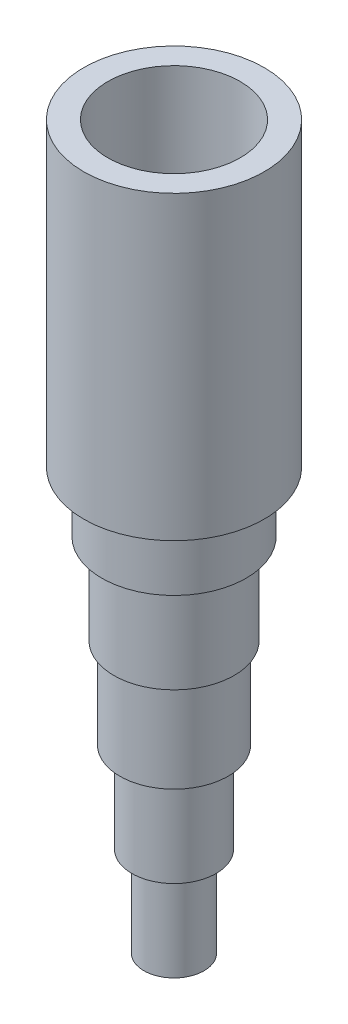
ISO-10303-21;
HEADER;
FILE_DESCRIPTION(('STEP AP214'),'2;1');
FILE_NAME('part.step','',(''),(''),'','','');
FILE_SCHEMA(('AUTOMOTIVE_DESIGN { 1 0 10303 214 1 1 1 1 }'));
ENDSEC;
DATA;
#1=APPLICATION_CONTEXT('core data for automotive mechanical design processes');
#2=APPLICATION_PROTOCOL_DEFINITION('international standard','automotive_design',2000,#1);
#3=PRODUCT_CONTEXT('',#1,'mechanical');
#4=PRODUCT('Part','Part','',(#3));
#5=PRODUCT_RELATED_PRODUCT_CATEGORY('part','',(#4));
#6=PRODUCT_DEFINITION_FORMATION('','',#4);
#7=PRODUCT_DEFINITION_CONTEXT('part definition',#1,'design');
#8=PRODUCT_DEFINITION('design','',#6,#7);
#9=PRODUCT_DEFINITION_SHAPE('','',#8);
#10=(LENGTH_UNIT() NAMED_UNIT(*) SI_UNIT(.MILLI.,.METRE.));
#11=(NAMED_UNIT(*) PLANE_ANGLE_UNIT() SI_UNIT($,.RADIAN.));
#12=(NAMED_UNIT(*) SI_UNIT($,.STERADIAN.) SOLID_ANGLE_UNIT());
#13=UNCERTAINTY_MEASURE_WITH_UNIT(LENGTH_MEASURE(1.E-05),#10,'distance_accuracy_value','');
#14=(GEOMETRIC_REPRESENTATION_CONTEXT(3) GLOBAL_UNCERTAINTY_ASSIGNED_CONTEXT((#13)) GLOBAL_UNIT_ASSIGNED_CONTEXT((#10,
#11,#12)) REPRESENTATION_CONTEXT('',''));
#15=CARTESIAN_POINT('',(0.,0.,0.));
#16=DIRECTION('',(0.,0.,1.));
#17=DIRECTION('',(1.,0.,0.));
#18=AXIS2_PLACEMENT_3D('',#15,#16,#17);
#19=CARTESIAN_POINT('',(0.,15.5718226857457,0.));
#20=DIRECTION('',(0.,1.,0.));
#21=DIRECTION('',(0.,0.,1.));
#22=AXIS2_PLACEMENT_3D('',#19,#20,#21);
#23=PLANE('',#22);
#24=CARTESIAN_POINT('',(49.4708787534688,15.5718226857457,0.));
#25=DIRECTION('',(0.,-1.,0.));
#26=DIRECTION('',(0.,0.,-1.));
#27=AXIS2_PLACEMENT_3D('',#24,#25,#26);
#28=CIRCLE('',#27,7.61999999999999);
#29=CARTESIAN_POINT('',(49.4708787534688,15.5718226857457,-7.61999999999999));
#30=VERTEX_POINT('',#29);
#31=EDGE_CURVE('E10',#30,#30,#28,.T.);
#32=ORIENTED_EDGE('',*,*,#31,.F.);
#33=EDGE_LOOP('',(#32));
#34=FACE_BOUND('',#33,.T.);
#35=CARTESIAN_POINT('',(49.4708787534688,15.5718226857457,0.));
#36=DIRECTION('',(0.,-1.,0.));
#37=DIRECTION('',(0.,0.,-1.));
#38=AXIS2_PLACEMENT_3D('',#35,#36,#37);
#39=CIRCLE('',#38,9.52499999999999);
#40=CARTESIAN_POINT('',(49.4708787534688,15.5718226857457,-9.52499999999999));
#41=VERTEX_POINT('',#40);
#42=EDGE_CURVE('E92',#41,#41,#39,.T.);
#43=ORIENTED_EDGE('',*,*,#42,.T.);
#44=EDGE_LOOP('',(#43));
#45=FACE_BOUND('',#44,.T.);
#46=ADVANCED_FACE('F41',(#34,#45),#23,.F.);
#47=CARTESIAN_POINT('',(49.4708787534688,-38.2279704544824,0.));
#48=DIRECTION('',(0.,-1.,0.));
#49=DIRECTION('',(0.,0.,-1.));
#50=AXIS2_PLACEMENT_3D('',#47,#48,#49);
#51=CYLINDRICAL_SURFACE('',#50,7.61999999999999);
#52=ORIENTED_EDGE('',*,*,#31,.T.);
#53=EDGE_LOOP('',(#52));
#54=FACE_BOUND('',#53,.T.);
#55=CARTESIAN_POINT('',(49.4708787534688,9.22182268574573,0.));
#56=DIRECTION('',(0.,-1.,0.));
#57=DIRECTION('',(0.,0.,-1.));
#58=AXIS2_PLACEMENT_3D('',#55,#56,#57);
#59=CIRCLE('',#58,7.61999999999999);
#60=CARTESIAN_POINT('',(49.4708787534688,9.22182268574573,-7.61999999999999));
#61=VERTEX_POINT('',#60);
#62=EDGE_CURVE('E48',#61,#61,#59,.T.);
#63=ORIENTED_EDGE('',*,*,#62,.F.);
#64=EDGE_LOOP('',(#63));
#65=FACE_BOUND('',#64,.T.);
#66=ADVANCED_FACE('F166',(#54,#65),#51,.T.);
#67=CARTESIAN_POINT('',(0.,9.22182268574573,0.));
#68=DIRECTION('',(0.,1.,0.));
#69=DIRECTION('',(0.,0.,1.));
#70=AXIS2_PLACEMENT_3D('',#67,#68,#69);
#71=PLANE('',#70);
#72=CARTESIAN_POINT('',(49.4708787534688,9.22182268574573,0.));
#73=DIRECTION('',(0.,-1.,0.));
#74=DIRECTION('',(0.,0.,-1.));
#75=AXIS2_PLACEMENT_3D('',#72,#73,#74);
#76=CIRCLE('',#75,6.35);
#77=CARTESIAN_POINT('',(49.4708787534688,9.22182268574573,-6.35));
#78=VERTEX_POINT('',#77);
#79=EDGE_CURVE('E53',#78,#78,#76,.T.);
#80=ORIENTED_EDGE('',*,*,#79,.F.);
#81=EDGE_LOOP('',(#80));
#82=FACE_BOUND('',#81,.T.);
#83=ORIENTED_EDGE('',*,*,#62,.T.);
#84=EDGE_LOOP('',(#83));
#85=FACE_BOUND('',#84,.T.);
#86=ADVANCED_FACE('F171',(#82,#85),#71,.F.);
#87=CARTESIAN_POINT('',(49.4708787534688,-38.2279704544824,0.));
#88=DIRECTION('',(0.,-1.,0.));
#89=DIRECTION('',(0.,0.,-1.));
#90=AXIS2_PLACEMENT_3D('',#87,#88,#89);
#91=CYLINDRICAL_SURFACE('',#90,6.35);
#92=ORIENTED_EDGE('',*,*,#79,.T.);
#93=EDGE_LOOP('',(#92));
#94=FACE_BOUND('',#93,.T.);
#95=CARTESIAN_POINT('',(49.4708787534688,-0.30317731425427,0.));
#96=DIRECTION('',(0.,-1.,0.));
#97=DIRECTION('',(0.,0.,-1.));
#98=AXIS2_PLACEMENT_3D('',#95,#96,#97);
#99=CIRCLE('',#98,6.35);
#100=CARTESIAN_POINT('',(49.4708787534688,-0.30317731425427,-6.35));
#101=VERTEX_POINT('',#100);
#102=EDGE_CURVE('E58',#101,#101,#99,.T.);
#103=ORIENTED_EDGE('',*,*,#102,.F.);
#104=EDGE_LOOP('',(#103));
#105=FACE_BOUND('',#104,.T.);
#106=ADVANCED_FACE('F216',(#94,#105),#91,.T.);
#107=CARTESIAN_POINT('',(0.,-0.30317731425427,0.));
#108=DIRECTION('',(0.,1.,0.));
#109=DIRECTION('',(0.,0.,1.));
#110=AXIS2_PLACEMENT_3D('',#107,#108,#109);
#111=PLANE('',#110);
#112=CARTESIAN_POINT('',(49.4708787534688,-0.30317731425427,0.));
#113=DIRECTION('',(0.,-1.,0.));
#114=DIRECTION('',(0.,0.,-1.));
#115=AXIS2_PLACEMENT_3D('',#112,#113,#114);
#116=CIRCLE('',#115,5.715);
#117=CARTESIAN_POINT('',(49.4708787534688,-0.30317731425427,-5.715));
#118=VERTEX_POINT('',#117);
#119=EDGE_CURVE('E64',#118,#118,#116,.T.);
#120=ORIENTED_EDGE('',*,*,#119,.F.);
#121=EDGE_LOOP('',(#120));
#122=FACE_BOUND('',#121,.T.);
#123=ORIENTED_EDGE('',*,*,#102,.T.);
#124=EDGE_LOOP('',(#123));
#125=FACE_BOUND('',#124,.T.);
#126=ADVANCED_FACE('F212',(#122,#125),#111,.F.);
#127=CARTESIAN_POINT('',(49.4708787534688,-38.2279704544824,0.));
#128=DIRECTION('',(0.,-1.,0.));
#129=DIRECTION('',(0.,0.,-1.));
#130=AXIS2_PLACEMENT_3D('',#127,#128,#129);
#131=CYLINDRICAL_SURFACE('',#130,5.715);
#132=ORIENTED_EDGE('',*,*,#119,.T.);
#133=EDGE_LOOP('',(#132));
#134=FACE_BOUND('',#133,.T.);
#135=CARTESIAN_POINT('',(49.4708787534688,-9.82817731425427,0.));
#136=DIRECTION('',(0.,-1.,0.));
#137=DIRECTION('',(0.,0.,-1.));
#138=AXIS2_PLACEMENT_3D('',#135,#136,#137);
#139=CIRCLE('',#138,5.715);
#140=CARTESIAN_POINT('',(49.4708787534688,-9.82817731425427,-5.715));
#141=VERTEX_POINT('',#140);
#142=EDGE_CURVE('E68',#141,#141,#139,.T.);
#143=ORIENTED_EDGE('',*,*,#142,.F.);
#144=EDGE_LOOP('',(#143));
#145=FACE_BOUND('',#144,.T.);
#146=ADVANCED_FACE('F208',(#134,#145),#131,.T.);
#147=CARTESIAN_POINT('',(0.,-9.82817731425427,0.));
#148=DIRECTION('',(0.,1.,0.));
#149=DIRECTION('',(0.,0.,1.));
#150=AXIS2_PLACEMENT_3D('',#147,#148,#149);
#151=PLANE('',#150);
#152=CARTESIAN_POINT('',(49.4708787534688,-9.82817731425427,0.));
#153=DIRECTION('',(0.,-1.,0.));
#154=DIRECTION('',(0.,0.,-1.));
#155=AXIS2_PLACEMENT_3D('',#152,#153,#154);
#156=CIRCLE('',#155,4.44499999999999);
#157=CARTESIAN_POINT('',(49.4708787534688,-9.82817731425427,-4.44499999999999));
#158=VERTEX_POINT('',#157);
#159=EDGE_CURVE('E72',#158,#158,#156,.T.);
#160=ORIENTED_EDGE('',*,*,#159,.F.);
#161=EDGE_LOOP('',(#160));
#162=FACE_BOUND('',#161,.T.);
#163=ORIENTED_EDGE('',*,*,#142,.T.);
#164=EDGE_LOOP('',(#163));
#165=FACE_BOUND('',#164,.T.);
#166=ADVANCED_FACE('F204',(#162,#165),#151,.F.);
#167=CARTESIAN_POINT('',(49.4708787534688,-38.2279704544824,0.));
#168=DIRECTION('',(0.,-1.,0.));
#169=DIRECTION('',(0.,0.,-1.));
#170=AXIS2_PLACEMENT_3D('',#167,#168,#169);
#171=CYLINDRICAL_SURFACE('',#170,4.44499999999999);
#172=ORIENTED_EDGE('',*,*,#159,.T.);
#173=EDGE_LOOP('',(#172));
#174=FACE_BOUND('',#173,.T.);
#175=CARTESIAN_POINT('',(49.4708787534688,-19.3531773142543,0.));
#176=DIRECTION('',(0.,-1.,0.));
#177=DIRECTION('',(0.,0.,-1.));
#178=AXIS2_PLACEMENT_3D('',#175,#176,#177);
#179=CIRCLE('',#178,4.44499999999999);
#180=CARTESIAN_POINT('',(49.4708787534688,-19.3531773142543,-4.44499999999999));
#181=VERTEX_POINT('',#180);
#182=EDGE_CURVE('E76',#181,#181,#179,.T.);
#183=ORIENTED_EDGE('',*,*,#182,.F.);
#184=EDGE_LOOP('',(#183));
#185=FACE_BOUND('',#184,.T.);
#186=ADVANCED_FACE('F200',(#174,#185),#171,.T.);
#187=CARTESIAN_POINT('',(0.,-19.3531773142543,0.));
#188=DIRECTION('',(0.,1.,0.));
#189=DIRECTION('',(0.,0.,1.));
#190=AXIS2_PLACEMENT_3D('',#187,#188,#189);
#191=PLANE('',#190);
#192=CARTESIAN_POINT('',(49.4708787534688,-19.3531773142543,0.));
#193=DIRECTION('',(0.,-1.,0.));
#194=DIRECTION('',(0.,0.,-1.));
#195=AXIS2_PLACEMENT_3D('',#192,#193,#194);
#196=CIRCLE('',#195,3.175);
#197=CARTESIAN_POINT('',(49.4708787534688,-19.3531773142543,-3.175));
#198=VERTEX_POINT('',#197);
#199=EDGE_CURVE('E80',#198,#198,#196,.T.);
#200=ORIENTED_EDGE('',*,*,#199,.F.);
#201=EDGE_LOOP('',(#200));
#202=FACE_BOUND('',#201,.T.);
#203=ORIENTED_EDGE('',*,*,#182,.T.);
#204=EDGE_LOOP('',(#203));
#205=FACE_BOUND('',#204,.T.);
#206=ADVANCED_FACE('F196',(#202,#205),#191,.F.);
#207=CARTESIAN_POINT('',(49.4708787534688,-38.2279704544824,0.));
#208=DIRECTION('',(0.,-1.,0.));
#209=DIRECTION('',(0.,0.,-1.));
#210=AXIS2_PLACEMENT_3D('',#207,#208,#209);
#211=CYLINDRICAL_SURFACE('',#210,3.175);
#212=ORIENTED_EDGE('',*,*,#199,.T.);
#213=EDGE_LOOP('',(#212));
#214=FACE_BOUND('',#213,.T.);
#215=CARTESIAN_POINT('',(49.4708787534688,-28.8781773142543,0.));
#216=DIRECTION('',(0.,-1.,0.));
#217=DIRECTION('',(0.,0.,-1.));
#218=AXIS2_PLACEMENT_3D('',#215,#216,#217);
#219=CIRCLE('',#218,3.175);
#220=CARTESIAN_POINT('',(49.4708787534688,-28.8781773142543,-3.175));
#221=VERTEX_POINT('',#220);
#222=EDGE_CURVE('E84',#221,#221,#219,.T.);
#223=ORIENTED_EDGE('',*,*,#222,.F.);
#224=EDGE_LOOP('',(#223));
#225=FACE_BOUND('',#224,.T.);
#226=ADVANCED_FACE('F189',(#214,#225),#211,.T.);
#227=CARTESIAN_POINT('',(0.,-28.8781773142543,0.));
#228=DIRECTION('',(0.,-1.,0.));
#229=DIRECTION('',(0.,0.,-1.));
#230=AXIS2_PLACEMENT_3D('',#227,#228,#229);
#231=PLANE('',#230);
#232=CARTESIAN_POINT('',(49.4708787534688,-28.8781773142543,0.));
#233=DIRECTION('',(0.,-1.,0.));
#234=DIRECTION('',(0.,0.,-1.));
#235=AXIS2_PLACEMENT_3D('',#232,#233,#234);
#236=CIRCLE('',#235,0.634999999999997);
#237=CARTESIAN_POINT('',(49.4708787534688,-28.8781773142543,-0.634999999999997));
#238=VERTEX_POINT('',#237);
#239=EDGE_CURVE('E101',#238,#238,#236,.T.);
#240=ORIENTED_EDGE('',*,*,#239,.F.);
#241=EDGE_LOOP('',(#240));
#242=FACE_BOUND('',#241,.T.);
#243=ORIENTED_EDGE('',*,*,#222,.T.);
#244=EDGE_LOOP('',(#243));
#245=FACE_BOUND('',#244,.T.);
#246=ADVANCED_FACE('F183',(#242,#245),#231,.T.);
#247=CARTESIAN_POINT('',(0.,47.3218226857457,0.));
#248=DIRECTION('',(0.,-1.,0.));
#249=DIRECTION('',(0.,0.,-1.));
#250=AXIS2_PLACEMENT_3D('',#247,#248,#249);
#251=PLANE('',#250);
#252=CARTESIAN_POINT('',(49.4708787534688,47.3218226857457,0.));
#253=DIRECTION('',(0.,-1.,0.));
#254=DIRECTION('',(0.,0.,-1.));
#255=AXIS2_PLACEMENT_3D('',#252,#253,#254);
#256=CIRCLE('',#255,6.98499999999999);
#257=CARTESIAN_POINT('',(49.4708787534688,47.3218226857457,-6.98499999999999));
#258=VERTEX_POINT('',#257);
#259=EDGE_CURVE('E97',#258,#258,#256,.T.);
#260=ORIENTED_EDGE('',*,*,#259,.T.);
#261=EDGE_LOOP('',(#260));
#262=FACE_BOUND('',#261,.T.);
#263=CARTESIAN_POINT('',(49.4708787534688,47.3218226857457,0.));
#264=DIRECTION('',(0.,-1.,0.));
#265=DIRECTION('',(0.,0.,-1.));
#266=AXIS2_PLACEMENT_3D('',#263,#264,#265);
#267=CIRCLE('',#266,9.525);
#268=CARTESIAN_POINT('',(49.4708787534688,47.3218226857457,-9.525));
#269=VERTEX_POINT('',#268);
#270=EDGE_CURVE('E88',#269,#269,#267,.T.);
#271=ORIENTED_EDGE('',*,*,#270,.F.);
#272=EDGE_LOOP('',(#271));
#273=FACE_BOUND('',#272,.T.);
#274=ADVANCED_FACE('F178',(#262,#273),#251,.F.);
#275=CARTESIAN_POINT('',(49.4708787534688,-38.2279704544824,0.));
#276=DIRECTION('',(0.,-1.,0.));
#277=DIRECTION('',(0.,0.,-1.));
#278=AXIS2_PLACEMENT_3D('',#275,#276,#277);
#279=CYLINDRICAL_SURFACE('',#278,9.525);
#280=ORIENTED_EDGE('',*,*,#42,.F.);
#281=EDGE_LOOP('',(#280));
#282=FACE_BOUND('',#281,.T.);
#283=ORIENTED_EDGE('',*,*,#270,.T.);
#284=EDGE_LOOP('',(#283));
#285=FACE_BOUND('',#284,.T.);
#286=ADVANCED_FACE('F175',(#282,#285),#279,.T.);
#287=CARTESIAN_POINT('',(0.,18.1118226857457,0.));
#288=DIRECTION('',(0.,1.,0.));
#289=DIRECTION('',(0.,0.,1.));
#290=AXIS2_PLACEMENT_3D('',#287,#288,#289);
#291=PLANE('',#290);
#292=CARTESIAN_POINT('',(49.4708787534688,18.1118226857457,0.));
#293=DIRECTION('',(0.,1.,0.));
#294=DIRECTION('',(0.,0.,1.));
#295=AXIS2_PLACEMENT_3D('',#292,#293,#294);
#296=CIRCLE('',#295,5.07999999999999);
#297=CARTESIAN_POINT('',(49.4708787534688,18.1118226857457,5.07999999999999));
#298=VERTEX_POINT('',#297);
#299=EDGE_CURVE('E96',#298,#298,#296,.F.);
#300=ORIENTED_EDGE('',*,*,#299,.T.);
#301=EDGE_LOOP('',(#300));
#302=FACE_BOUND('',#301,.T.);
#303=CARTESIAN_POINT('',(49.4708787534688,18.1118226857457,0.));
#304=DIRECTION('',(0.,1.,0.));
#305=DIRECTION('',(0.,0.,1.));
#306=AXIS2_PLACEMENT_3D('',#303,#304,#305);
#307=CIRCLE('',#306,6.98499999999999);
#308=CARTESIAN_POINT('',(49.4708787534688,18.1118226857457,6.98499999999999));
#309=VERTEX_POINT('',#308);
#310=EDGE_CURVE('E102',#309,#309,#307,.F.);
#311=ORIENTED_EDGE('',*,*,#310,.F.);
#312=EDGE_LOOP('',(#311));
#313=FACE_BOUND('',#312,.T.);
#314=ADVANCED_FACE('F145',(#302,#313),#291,.T.);
#315=CARTESIAN_POINT('',(49.4708787534688,-38.2279704544824,0.));
#316=DIRECTION('',(0.,-1.,0.));
#317=DIRECTION('',(0.,0.,-1.));
#318=AXIS2_PLACEMENT_3D('',#315,#316,#317);
#319=CYLINDRICAL_SURFACE('',#318,5.07999999999999);
#320=ORIENTED_EDGE('',*,*,#299,.F.);
#321=EDGE_LOOP('',(#320));
#322=FACE_BOUND('',#321,.T.);
#323=CARTESIAN_POINT('',(49.4708787534688,11.7618226857457,0.));
#324=DIRECTION('',(0.,1.,0.));
#325=DIRECTION('',(0.,0.,1.));
#326=AXIS2_PLACEMENT_3D('',#323,#324,#325);
#327=CIRCLE('',#326,5.07999999999999);
#328=CARTESIAN_POINT('',(49.4708787534688,11.7618226857457,5.07999999999999));
#329=VERTEX_POINT('',#328);
#330=EDGE_CURVE('E134',#329,#329,#327,.F.);
#331=ORIENTED_EDGE('',*,*,#330,.T.);
#332=EDGE_LOOP('',(#331));
#333=FACE_BOUND('',#332,.T.);
#334=ADVANCED_FACE('F148',(#322,#333),#319,.F.);
#335=CARTESIAN_POINT('',(0.,11.7618226857457,0.));
#336=DIRECTION('',(0.,1.,0.));
#337=DIRECTION('',(0.,0.,1.));
#338=AXIS2_PLACEMENT_3D('',#335,#336,#337);
#339=PLANE('',#338);
#340=CARTESIAN_POINT('',(49.4708787534688,11.7618226857457,0.));
#341=DIRECTION('',(0.,1.,0.));
#342=DIRECTION('',(0.,0.,1.));
#343=AXIS2_PLACEMENT_3D('',#340,#341,#342);
#344=CIRCLE('',#343,3.81);
#345=CARTESIAN_POINT('',(49.4708787534688,11.7618226857457,3.81));
#346=VERTEX_POINT('',#345);
#347=EDGE_CURVE('E130',#346,#346,#344,.F.);
#348=ORIENTED_EDGE('',*,*,#347,.T.);
#349=EDGE_LOOP('',(#348));
#350=FACE_BOUND('',#349,.T.);
#351=ORIENTED_EDGE('',*,*,#330,.F.);
#352=EDGE_LOOP('',(#351));
#353=FACE_BOUND('',#352,.T.);
#354=ADVANCED_FACE('F151',(#350,#353),#339,.T.);
#355=CARTESIAN_POINT('',(49.4708787534688,-38.2279704544824,0.));
#356=DIRECTION('',(0.,-1.,0.));
#357=DIRECTION('',(0.,0.,-1.));
#358=AXIS2_PLACEMENT_3D('',#355,#356,#357);
#359=CYLINDRICAL_SURFACE('',#358,3.81);
#360=ORIENTED_EDGE('',*,*,#347,.F.);
#361=EDGE_LOOP('',(#360));
#362=FACE_BOUND('',#361,.T.);
#363=CARTESIAN_POINT('',(49.4708787534688,2.23682268574573,0.));
#364=DIRECTION('',(0.,1.,0.));
#365=DIRECTION('',(0.,0.,1.));
#366=AXIS2_PLACEMENT_3D('',#363,#364,#365);
#367=CIRCLE('',#366,3.81);
#368=CARTESIAN_POINT('',(49.4708787534688,2.23682268574573,3.81));
#369=VERTEX_POINT('',#368);
#370=EDGE_CURVE('E126',#369,#369,#367,.F.);
#371=ORIENTED_EDGE('',*,*,#370,.T.);
#372=EDGE_LOOP('',(#371));
#373=FACE_BOUND('',#372,.T.);
#374=ADVANCED_FACE('F156',(#362,#373),#359,.F.);
#375=CARTESIAN_POINT('',(0.,2.23682268574573,0.));
#376=DIRECTION('',(0.,1.,0.));
#377=DIRECTION('',(0.,0.,1.));
#378=AXIS2_PLACEMENT_3D('',#375,#376,#377);
#379=PLANE('',#378);
#380=CARTESIAN_POINT('',(49.4708787534688,2.23682268574573,0.));
#381=DIRECTION('',(0.,1.,0.));
#382=DIRECTION('',(0.,0.,1.));
#383=AXIS2_PLACEMENT_3D('',#380,#381,#382);
#384=CIRCLE('',#383,3.175);
#385=CARTESIAN_POINT('',(49.4708787534688,2.23682268574573,3.175));
#386=VERTEX_POINT('',#385);
#387=EDGE_CURVE('E122',#386,#386,#384,.F.);
#388=ORIENTED_EDGE('',*,*,#387,.T.);
#389=EDGE_LOOP('',(#388));
#390=FACE_BOUND('',#389,.T.);
#391=ORIENTED_EDGE('',*,*,#370,.F.);
#392=EDGE_LOOP('',(#391));
#393=FACE_BOUND('',#392,.T.);
#394=ADVANCED_FACE('F162',(#390,#393),#379,.T.);
#395=CARTESIAN_POINT('',(49.4708787534688,-38.2279704544824,0.));
#396=DIRECTION('',(0.,-1.,0.));
#397=DIRECTION('',(0.,0.,-1.));
#398=AXIS2_PLACEMENT_3D('',#395,#396,#397);
#399=CYLINDRICAL_SURFACE('',#398,3.175);
#400=ORIENTED_EDGE('',*,*,#387,.F.);
#401=EDGE_LOOP('',(#400));
#402=FACE_BOUND('',#401,.T.);
#403=CARTESIAN_POINT('',(49.4708787534688,-7.28817731425427,0.));
#404=DIRECTION('',(0.,1.,0.));
#405=DIRECTION('',(0.,0.,1.));
#406=AXIS2_PLACEMENT_3D('',#403,#404,#405);
#407=CIRCLE('',#406,3.175);
#408=CARTESIAN_POINT('',(49.4708787534688,-7.28817731425427,3.175));
#409=VERTEX_POINT('',#408);
#410=EDGE_CURVE('E118',#409,#409,#407,.F.);
#411=ORIENTED_EDGE('',*,*,#410,.T.);
#412=EDGE_LOOP('',(#411));
#413=FACE_BOUND('',#412,.T.);
#414=ADVANCED_FACE('F310',(#402,#413),#399,.F.);
#415=CARTESIAN_POINT('',(0.,-7.28817731425427,0.));
#416=DIRECTION('',(0.,1.,0.));
#417=DIRECTION('',(0.,0.,1.));
#418=AXIS2_PLACEMENT_3D('',#415,#416,#417);
#419=PLANE('',#418);
#420=CARTESIAN_POINT('',(49.4708787534688,-7.28817731425427,0.));
#421=DIRECTION('',(0.,1.,0.));
#422=DIRECTION('',(0.,0.,1.));
#423=AXIS2_PLACEMENT_3D('',#420,#421,#422);
#424=CIRCLE('',#423,1.90499999999999);
#425=CARTESIAN_POINT('',(49.4708787534688,-7.28817731425427,1.90499999999999));
#426=VERTEX_POINT('',#425);
#427=EDGE_CURVE('E114',#426,#426,#424,.F.);
#428=ORIENTED_EDGE('',*,*,#427,.T.);
#429=EDGE_LOOP('',(#428));
#430=FACE_BOUND('',#429,.T.);
#431=ORIENTED_EDGE('',*,*,#410,.F.);
#432=EDGE_LOOP('',(#431));
#433=FACE_BOUND('',#432,.T.);
#434=ADVANCED_FACE('F320',(#430,#433),#419,.T.);
#435=CARTESIAN_POINT('',(49.4708787534688,-38.2279704544824,0.));
#436=DIRECTION('',(0.,-1.,0.));
#437=DIRECTION('',(0.,0.,-1.));
#438=AXIS2_PLACEMENT_3D('',#435,#436,#437);
#439=CYLINDRICAL_SURFACE('',#438,1.90499999999999);
#440=ORIENTED_EDGE('',*,*,#427,.F.);
#441=EDGE_LOOP('',(#440));
#442=FACE_BOUND('',#441,.T.);
#443=CARTESIAN_POINT('',(49.4708787534688,-16.8131773142543,0.));
#444=DIRECTION('',(0.,1.,0.));
#445=DIRECTION('',(0.,0.,1.));
#446=AXIS2_PLACEMENT_3D('',#443,#444,#445);
#447=CIRCLE('',#446,1.90499999999999);
#448=CARTESIAN_POINT('',(49.4708787534688,-16.8131773142543,1.90499999999999));
#449=VERTEX_POINT('',#448);
#450=EDGE_CURVE('E110',#449,#449,#447,.F.);
#451=ORIENTED_EDGE('',*,*,#450,.T.);
#452=EDGE_LOOP('',(#451));
#453=FACE_BOUND('',#452,.T.);
#454=ADVANCED_FACE('F332',(#442,#453),#439,.F.);
#455=CARTESIAN_POINT('',(0.,-16.8131773142543,0.));
#456=DIRECTION('',(0.,1.,0.));
#457=DIRECTION('',(0.,0.,1.));
#458=AXIS2_PLACEMENT_3D('',#455,#456,#457);
#459=PLANE('',#458);
#460=CARTESIAN_POINT('',(49.4708787534688,-16.8131773142543,0.));
#461=DIRECTION('',(0.,1.,0.));
#462=DIRECTION('',(0.,0.,1.));
#463=AXIS2_PLACEMENT_3D('',#460,#461,#462);
#464=CIRCLE('',#463,0.634999999999997);
#465=CARTESIAN_POINT('',(49.4708787534688,-16.8131773142543,0.634999999999997));
#466=VERTEX_POINT('',#465);
#467=EDGE_CURVE('E106',#466,#466,#464,.F.);
#468=ORIENTED_EDGE('',*,*,#467,.T.);
#469=EDGE_LOOP('',(#468));
#470=FACE_BOUND('',#469,.T.);
#471=ORIENTED_EDGE('',*,*,#450,.F.);
#472=EDGE_LOOP('',(#471));
#473=FACE_BOUND('',#472,.T.);
#474=ADVANCED_FACE('F342',(#470,#473),#459,.T.);
#475=CARTESIAN_POINT('',(49.4708787534688,-38.2279704544824,0.));
#476=DIRECTION('',(0.,-1.,0.));
#477=DIRECTION('',(0.,0.,-1.));
#478=AXIS2_PLACEMENT_3D('',#475,#476,#477);
#479=CYLINDRICAL_SURFACE('',#478,0.634999999999997);
#480=ORIENTED_EDGE('',*,*,#467,.F.);
#481=EDGE_LOOP('',(#480));
#482=FACE_BOUND('',#481,.T.);
#483=ORIENTED_EDGE('',*,*,#239,.T.);
#484=EDGE_LOOP('',(#483));
#485=FACE_BOUND('',#484,.T.);
#486=ADVANCED_FACE('F354',(#482,#485),#479,.F.);
#487=CARTESIAN_POINT('',(49.4708787534688,-38.2279704544824,0.));
#488=DIRECTION('',(0.,-1.,0.));
#489=DIRECTION('',(0.,0.,-1.));
#490=AXIS2_PLACEMENT_3D('',#487,#488,#489);
#491=CYLINDRICAL_SURFACE('',#490,6.98499999999999);
#492=ORIENTED_EDGE('',*,*,#310,.T.);
#493=EDGE_LOOP('',(#492));
#494=FACE_BOUND('',#493,.T.);
#495=ORIENTED_EDGE('',*,*,#259,.F.);
#496=EDGE_LOOP('',(#495));
#497=FACE_BOUND('',#496,.T.);
#498=ADVANCED_FACE('F364',(#494,#497),#491,.F.);
#499=CLOSED_SHELL('',(#46,#66,#86,#106,#126,#146,#166,#186,#206,#226,#246,#274,#286,#314,#334,
#354,#374,#394,#414,#434,#454,#474,#486,#498));
#500=MANIFOLD_SOLID_BREP('B2',#499);
#501=ADVANCED_BREP_SHAPE_REPRESENTATION('',(#18,#500),#14);
#502=SHAPE_DEFINITION_REPRESENTATION(#9,#501);
ENDSEC;
END-ISO-10303-21;
